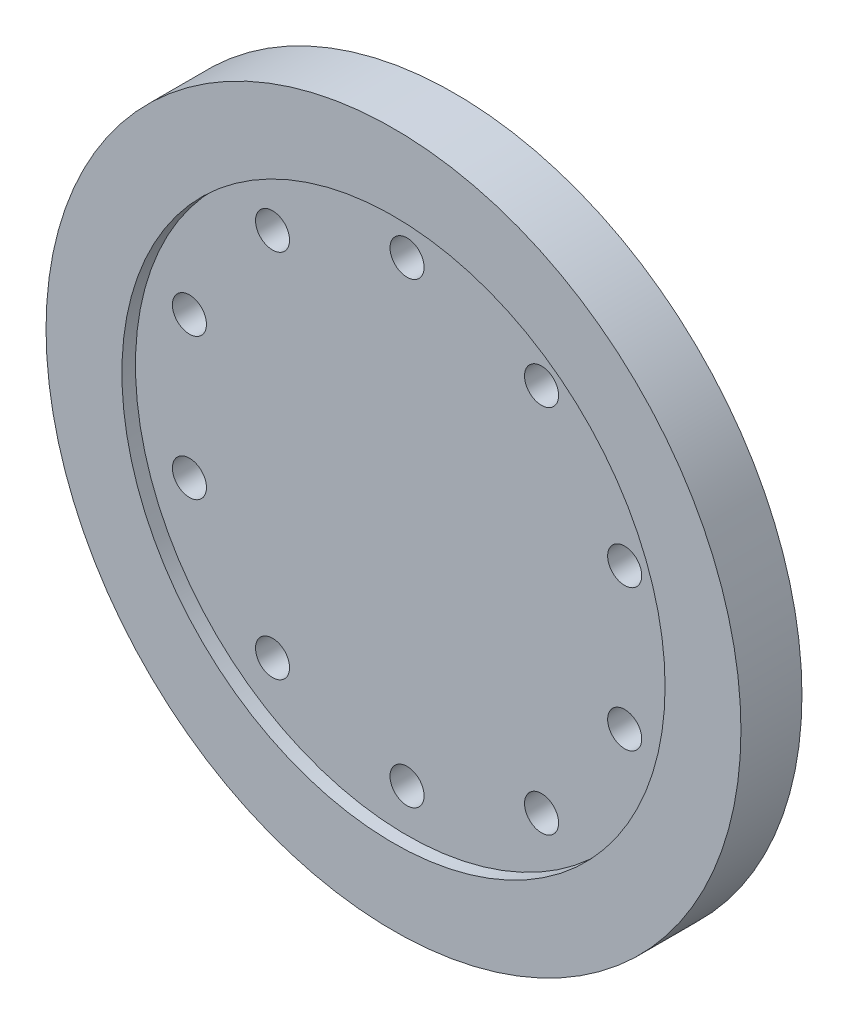
ISO-10303-21;
HEADER;
FILE_DESCRIPTION(('STEP AP214'),'2;1');
FILE_NAME('part.step','',(''),(''),'','','');
FILE_SCHEMA(('AUTOMOTIVE_DESIGN { 1 0 10303 214 1 1 1 1 }'));
ENDSEC;
DATA;
#1=APPLICATION_CONTEXT('core data for automotive mechanical design processes');
#2=APPLICATION_PROTOCOL_DEFINITION('international standard','automotive_design',2000,#1);
#3=PRODUCT_CONTEXT('',#1,'mechanical');
#4=PRODUCT('Part','Part','',(#3));
#5=PRODUCT_RELATED_PRODUCT_CATEGORY('part','',(#4));
#6=PRODUCT_DEFINITION_FORMATION('','',#4);
#7=PRODUCT_DEFINITION_CONTEXT('part definition',#1,'design');
#8=PRODUCT_DEFINITION('design','',#6,#7);
#9=PRODUCT_DEFINITION_SHAPE('','',#8);
#10=(LENGTH_UNIT() NAMED_UNIT(*) SI_UNIT(.MILLI.,.METRE.));
#11=(NAMED_UNIT(*) PLANE_ANGLE_UNIT() SI_UNIT($,.RADIAN.));
#12=(NAMED_UNIT(*) SI_UNIT($,.STERADIAN.) SOLID_ANGLE_UNIT());
#13=UNCERTAINTY_MEASURE_WITH_UNIT(LENGTH_MEASURE(1.E-05),#10,'distance_accuracy_value','');
#14=(GEOMETRIC_REPRESENTATION_CONTEXT(3) GLOBAL_UNCERTAINTY_ASSIGNED_CONTEXT((#13)) GLOBAL_UNIT_ASSIGNED_CONTEXT((#10,
#11,#12)) REPRESENTATION_CONTEXT('',''));
#15=CARTESIAN_POINT('',(0.,0.,0.));
#16=DIRECTION('',(0.,0.,1.));
#17=DIRECTION('',(1.,0.,0.));
#18=AXIS2_PLACEMENT_3D('',#15,#16,#17);
#19=CARTESIAN_POINT('',(-19.837752264871,27.3043235601545,-1.4));
#20=DIRECTION('',(0.,0.,-1.));
#21=DIRECTION('',(-1.,0.,0.));
#22=AXIS2_PLACEMENT_3D('',#19,#20,#21);
#23=CONICAL_SURFACE('',#22,2.5125,0.785398163397448);
#24=CARTESIAN_POINT('',(-19.837752264871,27.3043235601545,-4.5));
#25=DIRECTION('',(0.,0.,1.));
#26=DIRECTION('',(1.,0.,0.));
#27=AXIS2_PLACEMENT_3D('',#24,#25,#26);
#28=CIRCLE('',#27,5.6125);
#29=CARTESIAN_POINT('',(-14.225252264871,27.3043235601545,-4.5));
#30=VERTEX_POINT('',#29);
#31=EDGE_CURVE('E230',#30,#30,#28,.T.);
#32=ORIENTED_EDGE('',*,*,#31,.F.);
#33=EDGE_LOOP('',(#32));
#34=FACE_BOUND('',#33,.T.);
#35=CARTESIAN_POINT('',(-19.837752264871,27.3043235601545,-1.4));
#36=DIRECTION('',(0.,0.,1.));
#37=DIRECTION('',(1.,0.,0.));
#38=AXIS2_PLACEMENT_3D('',#35,#36,#37);
#39=CIRCLE('',#38,2.5125);
#40=CARTESIAN_POINT('',(-17.325252264871,27.3043235601545,-1.4));
#41=VERTEX_POINT('',#40);
#42=EDGE_CURVE('E195',#41,#41,#39,.T.);
#43=ORIENTED_EDGE('',*,*,#42,.T.);
#44=EDGE_LOOP('',(#43));
#45=FACE_BOUND('',#44,.T.);
#46=ADVANCED_FACE('F16',(#34,#45),#23,.F.);
#47=CARTESIAN_POINT('',(0.,33.75,-1.4));
#48=DIRECTION('',(0.,0.,-1.));
#49=DIRECTION('',(-1.,0.,0.));
#50=AXIS2_PLACEMENT_3D('',#47,#48,#49);
#51=CONICAL_SURFACE('',#50,2.5125,0.785398163397448);
#52=CARTESIAN_POINT('',(0.,33.75,-4.5));
#53=DIRECTION('',(0.,0.,1.));
#54=DIRECTION('',(1.,0.,0.));
#55=AXIS2_PLACEMENT_3D('',#52,#53,#54);
#56=CIRCLE('',#55,5.6125);
#57=CARTESIAN_POINT('',(5.6125,33.75,-4.5));
#58=VERTEX_POINT('',#57);
#59=EDGE_CURVE('E227',#58,#58,#56,.T.);
#60=ORIENTED_EDGE('',*,*,#59,.F.);
#61=EDGE_LOOP('',(#60));
#62=FACE_BOUND('',#61,.T.);
#63=CARTESIAN_POINT('',(0.,33.75,-1.4));
#64=DIRECTION('',(0.,0.,1.));
#65=DIRECTION('',(1.,0.,0.));
#66=AXIS2_PLACEMENT_3D('',#63,#64,#65);
#67=CIRCLE('',#66,2.5125);
#68=CARTESIAN_POINT('',(2.5125,33.75,-1.4));
#69=VERTEX_POINT('',#68);
#70=EDGE_CURVE('E196',#69,#69,#67,.T.);
#71=ORIENTED_EDGE('',*,*,#70,.T.);
#72=EDGE_LOOP('',(#71));
#73=FACE_BOUND('',#72,.T.);
#74=ADVANCED_FACE('F273',(#62,#73),#51,.F.);
#75=CARTESIAN_POINT('',(19.837752264871,-27.3043235601545,-1.4));
#76=DIRECTION('',(0.,0.,-1.));
#77=DIRECTION('',(-1.,0.,0.));
#78=AXIS2_PLACEMENT_3D('',#75,#76,#77);
#79=CONICAL_SURFACE('',#78,2.5125,0.785398163397448);
#80=CARTESIAN_POINT('',(19.837752264871,-27.3043235601545,-4.5));
#81=DIRECTION('',(0.,0.,1.));
#82=DIRECTION('',(1.,0.,0.));
#83=AXIS2_PLACEMENT_3D('',#80,#81,#82);
#84=CIRCLE('',#83,5.6125);
#85=CARTESIAN_POINT('',(25.450252264871,-27.3043235601545,-4.5));
#86=VERTEX_POINT('',#85);
#87=EDGE_CURVE('E229',#86,#86,#84,.T.);
#88=ORIENTED_EDGE('',*,*,#87,.F.);
#89=EDGE_LOOP('',(#88));
#90=FACE_BOUND('',#89,.T.);
#91=CARTESIAN_POINT('',(19.837752264871,-27.3043235601545,-1.4));
#92=DIRECTION('',(0.,0.,1.));
#93=DIRECTION('',(1.,0.,0.));
#94=AXIS2_PLACEMENT_3D('',#91,#92,#93);
#95=CIRCLE('',#94,2.5125);
#96=CARTESIAN_POINT('',(22.350252264871,-27.3043235601545,-1.4));
#97=VERTEX_POINT('',#96);
#98=EDGE_CURVE('E167',#97,#97,#95,.T.);
#99=ORIENTED_EDGE('',*,*,#98,.T.);
#100=EDGE_LOOP('',(#99));
#101=FACE_BOUND('',#100,.T.);
#102=ADVANCED_FACE('F168',(#90,#101),#79,.F.);
#103=CARTESIAN_POINT('',(0.,-33.75,-1.4));
#104=DIRECTION('',(0.,0.,-1.));
#105=DIRECTION('',(-1.,0.,0.));
#106=AXIS2_PLACEMENT_3D('',#103,#104,#105);
#107=CONICAL_SURFACE('',#106,2.5125,0.785398163397448);
#108=CARTESIAN_POINT('',(0.,-33.75,-4.5));
#109=DIRECTION('',(0.,0.,1.));
#110=DIRECTION('',(1.,0.,0.));
#111=AXIS2_PLACEMENT_3D('',#108,#109,#110);
#112=CIRCLE('',#111,5.6125);
#113=CARTESIAN_POINT('',(5.6125,-33.75,-4.5));
#114=VERTEX_POINT('',#113);
#115=EDGE_CURVE('E249',#114,#114,#112,.T.);
#116=ORIENTED_EDGE('',*,*,#115,.F.);
#117=EDGE_LOOP('',(#116));
#118=FACE_BOUND('',#117,.T.);
#119=CARTESIAN_POINT('',(0.,-33.75,-1.4));
#120=DIRECTION('',(0.,0.,1.));
#121=DIRECTION('',(1.,0.,0.));
#122=AXIS2_PLACEMENT_3D('',#119,#120,#121);
#123=CIRCLE('',#122,2.5125);
#124=CARTESIAN_POINT('',(2.5125,-33.75,-1.4));
#125=VERTEX_POINT('',#124);
#126=EDGE_CURVE('E182',#125,#125,#123,.T.);
#127=ORIENTED_EDGE('',*,*,#126,.T.);
#128=EDGE_LOOP('',(#127));
#129=FACE_BOUND('',#128,.T.);
#130=ADVANCED_FACE('F328',(#118,#129),#107,.F.);
#131=CARTESIAN_POINT('',(-19.837752264871,-27.3043235601545,-1.4));
#132=DIRECTION('',(0.,0.,-1.));
#133=DIRECTION('',(-1.,0.,0.));
#134=AXIS2_PLACEMENT_3D('',#131,#132,#133);
#135=CONICAL_SURFACE('',#134,2.5125,0.785398163397448);
#136=CARTESIAN_POINT('',(-19.837752264871,-27.3043235601545,-4.5));
#137=DIRECTION('',(0.,0.,1.));
#138=DIRECTION('',(1.,0.,0.));
#139=AXIS2_PLACEMENT_3D('',#136,#137,#138);
#140=CIRCLE('',#139,5.6125);
#141=CARTESIAN_POINT('',(-14.225252264871,-27.3043235601545,-4.5));
#142=VERTEX_POINT('',#141);
#143=EDGE_CURVE('E246',#142,#142,#140,.T.);
#144=ORIENTED_EDGE('',*,*,#143,.F.);
#145=EDGE_LOOP('',(#144));
#146=FACE_BOUND('',#145,.T.);
#147=CARTESIAN_POINT('',(-19.837752264871,-27.3043235601545,-1.4));
#148=DIRECTION('',(0.,0.,1.));
#149=DIRECTION('',(1.,0.,0.));
#150=AXIS2_PLACEMENT_3D('',#147,#148,#149);
#151=CIRCLE('',#150,2.5125);
#152=CARTESIAN_POINT('',(-17.325252264871,-27.3043235601545,-1.4));
#153=VERTEX_POINT('',#152);
#154=EDGE_CURVE('E231',#153,#153,#151,.T.);
#155=ORIENTED_EDGE('',*,*,#154,.T.);
#156=EDGE_LOOP('',(#155));
#157=FACE_BOUND('',#156,.T.);
#158=ADVANCED_FACE('F326',(#146,#157),#135,.F.);
#159=CARTESIAN_POINT('',(-32.0981574249615,10.4293235601545,-1.4));
#160=DIRECTION('',(0.,0.,-1.));
#161=DIRECTION('',(-1.,0.,0.));
#162=AXIS2_PLACEMENT_3D('',#159,#160,#161);
#163=CONICAL_SURFACE('',#162,2.5125,0.785398163397448);
#164=CARTESIAN_POINT('',(-32.0981574249615,10.4293235601545,-4.5));
#165=DIRECTION('',(0.,0.,1.));
#166=DIRECTION('',(1.,0.,0.));
#167=AXIS2_PLACEMENT_3D('',#164,#165,#166);
#168=CIRCLE('',#167,5.6125);
#169=CARTESIAN_POINT('',(-26.4856574249615,10.4293235601545,-4.5));
#170=VERTEX_POINT('',#169);
#171=EDGE_CURVE('E242',#170,#170,#168,.T.);
#172=ORIENTED_EDGE('',*,*,#171,.F.);
#173=EDGE_LOOP('',(#172));
#174=FACE_BOUND('',#173,.T.);
#175=CARTESIAN_POINT('',(-32.0981574249615,10.4293235601545,-1.4));
#176=DIRECTION('',(0.,0.,1.));
#177=DIRECTION('',(1.,0.,0.));
#178=AXIS2_PLACEMENT_3D('',#175,#176,#177);
#179=CIRCLE('',#178,2.5125);
#180=CARTESIAN_POINT('',(-29.5856574249614,10.4293235601545,-1.4));
#181=VERTEX_POINT('',#180);
#182=EDGE_CURVE('E204',#181,#181,#179,.T.);
#183=ORIENTED_EDGE('',*,*,#182,.T.);
#184=EDGE_LOOP('',(#183));
#185=FACE_BOUND('',#184,.T.);
#186=ADVANCED_FACE('F306',(#174,#185),#163,.F.);
#187=CARTESIAN_POINT('',(-32.0981574249615,-10.4293235601545,-1.4));
#188=DIRECTION('',(0.,0.,-1.));
#189=DIRECTION('',(-1.,0.,0.));
#190=AXIS2_PLACEMENT_3D('',#187,#188,#189);
#191=CONICAL_SURFACE('',#190,2.5125,0.785398163397448);
#192=CARTESIAN_POINT('',(-32.0981574249615,-10.4293235601545,-4.5));
#193=DIRECTION('',(0.,0.,1.));
#194=DIRECTION('',(1.,0.,0.));
#195=AXIS2_PLACEMENT_3D('',#192,#193,#194);
#196=CIRCLE('',#195,5.6125);
#197=CARTESIAN_POINT('',(-26.4856574249615,-10.4293235601545,-4.5));
#198=VERTEX_POINT('',#197);
#199=EDGE_CURVE('E239',#198,#198,#196,.T.);
#200=ORIENTED_EDGE('',*,*,#199,.F.);
#201=EDGE_LOOP('',(#200));
#202=FACE_BOUND('',#201,.T.);
#203=CARTESIAN_POINT('',(-32.0981574249615,-10.4293235601545,-1.4));
#204=DIRECTION('',(0.,0.,1.));
#205=DIRECTION('',(1.,0.,0.));
#206=AXIS2_PLACEMENT_3D('',#203,#204,#205);
#207=CIRCLE('',#206,2.5125);
#208=CARTESIAN_POINT('',(-29.5856574249614,-10.4293235601545,-1.4));
#209=VERTEX_POINT('',#208);
#210=EDGE_CURVE('E203',#209,#209,#207,.T.);
#211=ORIENTED_EDGE('',*,*,#210,.T.);
#212=EDGE_LOOP('',(#211));
#213=FACE_BOUND('',#212,.T.);
#214=ADVANCED_FACE('F302',(#202,#213),#191,.F.);
#215=CARTESIAN_POINT('',(32.0981574249615,-10.4293235601545,-1.4));
#216=DIRECTION('',(0.,0.,-1.));
#217=DIRECTION('',(-1.,0.,0.));
#218=AXIS2_PLACEMENT_3D('',#215,#216,#217);
#219=CONICAL_SURFACE('',#218,2.5125,0.785398163397448);
#220=CARTESIAN_POINT('',(32.0981574249615,-10.4293235601545,-4.5));
#221=DIRECTION('',(0.,0.,1.));
#222=DIRECTION('',(1.,0.,0.));
#223=AXIS2_PLACEMENT_3D('',#220,#221,#222);
#224=CIRCLE('',#223,5.6125);
#225=CARTESIAN_POINT('',(37.7106574249614,-10.4293235601545,-4.5));
#226=VERTEX_POINT('',#225);
#227=EDGE_CURVE('E20',#226,#226,#224,.T.);
#228=ORIENTED_EDGE('',*,*,#227,.F.);
#229=EDGE_LOOP('',(#228));
#230=FACE_BOUND('',#229,.T.);
#231=CARTESIAN_POINT('',(32.0981574249615,-10.4293235601545,-1.4));
#232=DIRECTION('',(0.,0.,1.));
#233=DIRECTION('',(1.,0.,0.));
#234=AXIS2_PLACEMENT_3D('',#231,#232,#233);
#235=CIRCLE('',#234,2.5125);
#236=CARTESIAN_POINT('',(34.6106574249615,-10.4293235601545,-1.4));
#237=VERTEX_POINT('',#236);
#238=EDGE_CURVE('E179',#237,#237,#235,.T.);
#239=ORIENTED_EDGE('',*,*,#238,.T.);
#240=EDGE_LOOP('',(#239));
#241=FACE_BOUND('',#240,.T.);
#242=ADVANCED_FACE('F305',(#230,#241),#219,.F.);
#243=CARTESIAN_POINT('',(32.0981574249615,10.4293235601545,-1.4));
#244=DIRECTION('',(0.,0.,-1.));
#245=DIRECTION('',(-1.,0.,0.));
#246=AXIS2_PLACEMENT_3D('',#243,#244,#245);
#247=CONICAL_SURFACE('',#246,2.5125,0.785398163397448);
#248=CARTESIAN_POINT('',(32.0981574249615,10.4293235601545,-4.5));
#249=DIRECTION('',(0.,0.,1.));
#250=DIRECTION('',(1.,0.,0.));
#251=AXIS2_PLACEMENT_3D('',#248,#249,#250);
#252=CIRCLE('',#251,5.6125);
#253=CARTESIAN_POINT('',(37.7106574249614,10.4293235601545,-4.5));
#254=VERTEX_POINT('',#253);
#255=EDGE_CURVE('E362',#254,#254,#252,.T.);
#256=ORIENTED_EDGE('',*,*,#255,.F.);
#257=EDGE_LOOP('',(#256));
#258=FACE_BOUND('',#257,.T.);
#259=CARTESIAN_POINT('',(32.0981574249615,10.4293235601545,-1.4));
#260=DIRECTION('',(0.,0.,1.));
#261=DIRECTION('',(1.,0.,0.));
#262=AXIS2_PLACEMENT_3D('',#259,#260,#261);
#263=CIRCLE('',#262,2.5125);
#264=CARTESIAN_POINT('',(34.6106574249615,10.4293235601545,-1.4));
#265=VERTEX_POINT('',#264);
#266=EDGE_CURVE('E226',#265,#265,#263,.T.);
#267=ORIENTED_EDGE('',*,*,#266,.T.);
#268=EDGE_LOOP('',(#267));
#269=FACE_BOUND('',#268,.T.);
#270=ADVANCED_FACE('F300',(#258,#269),#247,.F.);
#271=CARTESIAN_POINT('',(19.837752264871,27.3043235601545,-1.4));
#272=DIRECTION('',(0.,0.,-1.));
#273=DIRECTION('',(-1.,0.,0.));
#274=AXIS2_PLACEMENT_3D('',#271,#272,#273);
#275=CONICAL_SURFACE('',#274,2.5125,0.785398163397448);
#276=CARTESIAN_POINT('',(19.837752264871,27.3043235601545,-4.5));
#277=DIRECTION('',(0.,0.,1.));
#278=DIRECTION('',(1.,0.,0.));
#279=AXIS2_PLACEMENT_3D('',#276,#277,#278);
#280=CIRCLE('',#279,5.6125);
#281=CARTESIAN_POINT('',(25.450252264871,27.3043235601545,-4.5));
#282=VERTEX_POINT('',#281);
#283=EDGE_CURVE('E27',#282,#282,#280,.T.);
#284=ORIENTED_EDGE('',*,*,#283,.F.);
#285=EDGE_LOOP('',(#284));
#286=FACE_BOUND('',#285,.T.);
#287=CARTESIAN_POINT('',(19.837752264871,27.3043235601545,-1.4));
#288=DIRECTION('',(0.,0.,1.));
#289=DIRECTION('',(1.,0.,0.));
#290=AXIS2_PLACEMENT_3D('',#287,#288,#289);
#291=CIRCLE('',#290,2.5125);
#292=CARTESIAN_POINT('',(22.350252264871,27.3043235601545,-1.4));
#293=VERTEX_POINT('',#292);
#294=EDGE_CURVE('E207',#293,#293,#291,.T.);
#295=ORIENTED_EDGE('',*,*,#294,.T.);
#296=EDGE_LOOP('',(#295));
#297=FACE_BOUND('',#296,.T.);
#298=ADVANCED_FACE('F296',(#286,#297),#275,.F.);
#299=CARTESIAN_POINT('',(0.,0.,2.5));
#300=DIRECTION('',(0.,0.,1.));
#301=DIRECTION('',(1.,0.,0.));
#302=AXIS2_PLACEMENT_3D('',#299,#300,#301);
#303=PLANE('',#302);
#304=CARTESIAN_POINT('',(0.,0.,2.5));
#305=DIRECTION('',(0.,0.,1.));
#306=DIRECTION('',(1.,0.,0.));
#307=AXIS2_PLACEMENT_3D('',#304,#305,#306);
#308=CIRCLE('',#307,40.06);
#309=CARTESIAN_POINT('',(40.06,0.,2.5));
#310=VERTEX_POINT('',#309);
#311=EDGE_CURVE('E11',#310,#310,#308,.T.);
#312=ORIENTED_EDGE('',*,*,#311,.T.);
#313=EDGE_LOOP('',(#312));
#314=FACE_BOUND('',#313,.T.);
#315=CARTESIAN_POINT('',(-19.837752264871,27.3043235601545,2.5));
#316=DIRECTION('',(0.,0.,1.));
#317=DIRECTION('',(1.,0.,0.));
#318=AXIS2_PLACEMENT_3D('',#315,#316,#317);
#319=CIRCLE('',#318,2.5125);
#320=CARTESIAN_POINT('',(-17.325252264871,27.3043235601545,2.5));
#321=VERTEX_POINT('',#320);
#322=EDGE_CURVE('E208',#321,#321,#319,.T.);
#323=ORIENTED_EDGE('',*,*,#322,.F.);
#324=EDGE_LOOP('',(#323));
#325=FACE_BOUND('',#324,.T.);
#326=CARTESIAN_POINT('',(-32.0981574249615,10.4293235601545,2.5));
#327=DIRECTION('',(0.,0.,1.));
#328=DIRECTION('',(1.,0.,0.));
#329=AXIS2_PLACEMENT_3D('',#326,#327,#328);
#330=CIRCLE('',#329,2.5125);
#331=CARTESIAN_POINT('',(-29.5856574249614,10.4293235601545,2.5));
#332=VERTEX_POINT('',#331);
#333=EDGE_CURVE('E200',#332,#332,#330,.T.);
#334=ORIENTED_EDGE('',*,*,#333,.F.);
#335=EDGE_LOOP('',(#334));
#336=FACE_BOUND('',#335,.T.);
#337=CARTESIAN_POINT('',(-32.0981574249615,-10.4293235601545,2.5));
#338=DIRECTION('',(0.,0.,1.));
#339=DIRECTION('',(1.,0.,0.));
#340=AXIS2_PLACEMENT_3D('',#337,#338,#339);
#341=CIRCLE('',#340,2.5125);
#342=CARTESIAN_POINT('',(-29.5856574249614,-10.4293235601545,2.5));
#343=VERTEX_POINT('',#342);
#344=EDGE_CURVE('E235',#343,#343,#341,.T.);
#345=ORIENTED_EDGE('',*,*,#344,.F.);
#346=EDGE_LOOP('',(#345));
#347=FACE_BOUND('',#346,.T.);
#348=CARTESIAN_POINT('',(-19.837752264871,-27.3043235601545,2.5));
#349=DIRECTION('',(0.,0.,1.));
#350=DIRECTION('',(1.,0.,0.));
#351=AXIS2_PLACEMENT_3D('',#348,#349,#350);
#352=CIRCLE('',#351,2.5125);
#353=CARTESIAN_POINT('',(-17.325252264871,-27.3043235601545,2.5));
#354=VERTEX_POINT('',#353);
#355=EDGE_CURVE('E234',#354,#354,#352,.T.);
#356=ORIENTED_EDGE('',*,*,#355,.F.);
#357=EDGE_LOOP('',(#356));
#358=FACE_BOUND('',#357,.T.);
#359=CARTESIAN_POINT('',(0.,-33.75,2.5));
#360=DIRECTION('',(0.,0.,1.));
#361=DIRECTION('',(1.,0.,0.));
#362=AXIS2_PLACEMENT_3D('',#359,#360,#361);
#363=CIRCLE('',#362,2.5125);
#364=CARTESIAN_POINT('',(2.5125,-33.75,2.5));
#365=VERTEX_POINT('',#364);
#366=EDGE_CURVE('E172',#365,#365,#363,.T.);
#367=ORIENTED_EDGE('',*,*,#366,.F.);
#368=EDGE_LOOP('',(#367));
#369=FACE_BOUND('',#368,.T.);
#370=CARTESIAN_POINT('',(19.837752264871,-27.3043235601545,2.5));
#371=DIRECTION('',(0.,0.,1.));
#372=DIRECTION('',(1.,0.,0.));
#373=AXIS2_PLACEMENT_3D('',#370,#371,#372);
#374=CIRCLE('',#373,2.5125);
#375=CARTESIAN_POINT('',(22.350252264871,-27.3043235601545,2.5));
#376=VERTEX_POINT('',#375);
#377=EDGE_CURVE('E171',#376,#376,#374,.T.);
#378=ORIENTED_EDGE('',*,*,#377,.F.);
#379=EDGE_LOOP('',(#378));
#380=FACE_BOUND('',#379,.T.);
#381=CARTESIAN_POINT('',(32.0981574249615,-10.4293235601545,2.5));
#382=DIRECTION('',(0.,0.,1.));
#383=DIRECTION('',(1.,0.,0.));
#384=AXIS2_PLACEMENT_3D('',#381,#382,#383);
#385=CIRCLE('',#384,2.5125);
#386=CARTESIAN_POINT('',(34.6106574249615,-10.4293235601545,2.5));
#387=VERTEX_POINT('',#386);
#388=EDGE_CURVE('E238',#387,#387,#385,.T.);
#389=ORIENTED_EDGE('',*,*,#388,.F.);
#390=EDGE_LOOP('',(#389));
#391=FACE_BOUND('',#390,.T.);
#392=CARTESIAN_POINT('',(32.0981574249615,10.4293235601545,2.5));
#393=DIRECTION('',(0.,0.,1.));
#394=DIRECTION('',(1.,0.,0.));
#395=AXIS2_PLACEMENT_3D('',#392,#393,#394);
#396=CIRCLE('',#395,2.5125);
#397=CARTESIAN_POINT('',(34.6106574249615,10.4293235601545,2.5));
#398=VERTEX_POINT('',#397);
#399=EDGE_CURVE('E224',#398,#398,#396,.T.);
#400=ORIENTED_EDGE('',*,*,#399,.F.);
#401=EDGE_LOOP('',(#400));
#402=FACE_BOUND('',#401,.T.);
#403=CARTESIAN_POINT('',(19.837752264871,27.3043235601545,2.5));
#404=DIRECTION('',(0.,0.,1.));
#405=DIRECTION('',(1.,0.,0.));
#406=AXIS2_PLACEMENT_3D('',#403,#404,#405);
#407=CIRCLE('',#406,2.5125);
#408=CARTESIAN_POINT('',(22.350252264871,27.3043235601545,2.5));
#409=VERTEX_POINT('',#408);
#410=EDGE_CURVE('E199',#409,#409,#407,.T.);
#411=ORIENTED_EDGE('',*,*,#410,.F.);
#412=EDGE_LOOP('',(#411));
#413=FACE_BOUND('',#412,.T.);
#414=CARTESIAN_POINT('',(0.,33.75,2.5));
#415=DIRECTION('',(0.,0.,1.));
#416=DIRECTION('',(1.,0.,0.));
#417=AXIS2_PLACEMENT_3D('',#414,#415,#416);
#418=CIRCLE('',#417,2.5125);
#419=CARTESIAN_POINT('',(2.5125,33.75,2.5));
#420=VERTEX_POINT('',#419);
#421=EDGE_CURVE('E192',#420,#420,#418,.T.);
#422=ORIENTED_EDGE('',*,*,#421,.F.);
#423=EDGE_LOOP('',(#422));
#424=FACE_BOUND('',#423,.T.);
#425=ADVANCED_FACE('F299',(#314,#325,#336,#347,#358,#369,#380,#391,#402,#413,#424),#303,.T.);
#426=CARTESIAN_POINT('',(0.,0.,2.5));
#427=DIRECTION('',(0.,0.,1.));
#428=DIRECTION('',(1.,0.,0.));
#429=AXIS2_PLACEMENT_3D('',#426,#427,#428);
#430=CYLINDRICAL_SURFACE('',#429,40.06);
#431=CARTESIAN_POINT('',(0.,0.,4.5));
#432=DIRECTION('',(0.,0.,1.));
#433=DIRECTION('',(1.,0.,0.));
#434=AXIS2_PLACEMENT_3D('',#431,#432,#433);
#435=CIRCLE('',#434,40.06);
#436=CARTESIAN_POINT('',(40.06,0.,4.5));
#437=VERTEX_POINT('',#436);
#438=EDGE_CURVE('E190',#437,#437,#435,.T.);
#439=ORIENTED_EDGE('',*,*,#438,.T.);
#440=EDGE_LOOP('',(#439));
#441=FACE_BOUND('',#440,.T.);
#442=ORIENTED_EDGE('',*,*,#311,.F.);
#443=EDGE_LOOP('',(#442));
#444=FACE_BOUND('',#443,.T.);
#445=ADVANCED_FACE('F350',(#441,#444),#430,.F.);
#446=CARTESIAN_POINT('',(0.,0.,-4.5));
#447=DIRECTION('',(0.,0.,1.));
#448=DIRECTION('',(1.,0.,0.));
#449=AXIS2_PLACEMENT_3D('',#446,#447,#448);
#450=PLANE('',#449);
#451=CARTESIAN_POINT('',(0.,0.,-4.5));
#452=DIRECTION('',(0.,0.,1.));
#453=DIRECTION('',(1.,0.,0.));
#454=AXIS2_PLACEMENT_3D('',#451,#452,#453);
#455=CIRCLE('',#454,51.25);
#456=CARTESIAN_POINT('',(51.25,0.,-4.5));
#457=VERTEX_POINT('',#456);
#458=EDGE_CURVE('E187',#457,#457,#455,.T.);
#459=ORIENTED_EDGE('',*,*,#458,.F.);
#460=EDGE_LOOP('',(#459));
#461=FACE_BOUND('',#460,.T.);
#462=ORIENTED_EDGE('',*,*,#283,.T.);
#463=EDGE_LOOP('',(#462));
#464=FACE_BOUND('',#463,.T.);
#465=ORIENTED_EDGE('',*,*,#255,.T.);
#466=EDGE_LOOP('',(#465));
#467=FACE_BOUND('',#466,.T.);
#468=ORIENTED_EDGE('',*,*,#227,.T.);
#469=EDGE_LOOP('',(#468));
#470=FACE_BOUND('',#469,.T.);
#471=ORIENTED_EDGE('',*,*,#199,.T.);
#472=EDGE_LOOP('',(#471));
#473=FACE_BOUND('',#472,.T.);
#474=ORIENTED_EDGE('',*,*,#171,.T.);
#475=EDGE_LOOP('',(#474));
#476=FACE_BOUND('',#475,.T.);
#477=ORIENTED_EDGE('',*,*,#143,.T.);
#478=EDGE_LOOP('',(#477));
#479=FACE_BOUND('',#478,.T.);
#480=ORIENTED_EDGE('',*,*,#115,.T.);
#481=EDGE_LOOP('',(#480));
#482=FACE_BOUND('',#481,.T.);
#483=ORIENTED_EDGE('',*,*,#87,.T.);
#484=EDGE_LOOP('',(#483));
#485=FACE_BOUND('',#484,.T.);
#486=ORIENTED_EDGE('',*,*,#59,.T.);
#487=EDGE_LOOP('',(#486));
#488=FACE_BOUND('',#487,.T.);
#489=ORIENTED_EDGE('',*,*,#31,.T.);
#490=EDGE_LOOP('',(#489));
#491=FACE_BOUND('',#490,.T.);
#492=ADVANCED_FACE('F270',(#461,#464,#467,#470,#473,#476,#479,#482,#485,#488,#491),#450,.F.);
#493=CARTESIAN_POINT('',(0.,0.,4.5));
#494=DIRECTION('',(0.,0.,1.));
#495=DIRECTION('',(1.,0.,0.));
#496=AXIS2_PLACEMENT_3D('',#493,#494,#495);
#497=PLANE('',#496);
#498=CARTESIAN_POINT('',(0.,0.,4.5));
#499=DIRECTION('',(0.,0.,1.));
#500=DIRECTION('',(1.,0.,0.));
#501=AXIS2_PLACEMENT_3D('',#498,#499,#500);
#502=CIRCLE('',#501,51.25);
#503=CARTESIAN_POINT('',(51.25,0.,4.5));
#504=VERTEX_POINT('',#503);
#505=EDGE_CURVE('E191',#504,#504,#502,.T.);
#506=ORIENTED_EDGE('',*,*,#505,.T.);
#507=EDGE_LOOP('',(#506));
#508=FACE_BOUND('',#507,.T.);
#509=ORIENTED_EDGE('',*,*,#438,.F.);
#510=EDGE_LOOP('',(#509));
#511=FACE_BOUND('',#510,.T.);
#512=ADVANCED_FACE('F292',(#508,#511),#497,.T.);
#513=CARTESIAN_POINT('',(0.,0.,4.5));
#514=DIRECTION('',(0.,0.,-1.));
#515=DIRECTION('',(-1.,0.,0.));
#516=AXIS2_PLACEMENT_3D('',#513,#514,#515);
#517=CYLINDRICAL_SURFACE('',#516,51.25);
#518=ORIENTED_EDGE('',*,*,#458,.T.);
#519=EDGE_LOOP('',(#518));
#520=FACE_BOUND('',#519,.T.);
#521=ORIENTED_EDGE('',*,*,#505,.F.);
#522=EDGE_LOOP('',(#521));
#523=FACE_BOUND('',#522,.T.);
#524=ADVANCED_FACE('F291',(#520,#523),#517,.T.);
#525=CARTESIAN_POINT('',(-19.837752264871,27.3043235601545,4.5));
#526=DIRECTION('',(0.,0.,-1.));
#527=DIRECTION('',(-1.,0.,0.));
#528=AXIS2_PLACEMENT_3D('',#525,#526,#527);
#529=CYLINDRICAL_SURFACE('',#528,2.5125);
#530=ORIENTED_EDGE('',*,*,#322,.T.);
#531=EDGE_LOOP('',(#530));
#532=FACE_BOUND('',#531,.T.);
#533=ORIENTED_EDGE('',*,*,#42,.F.);
#534=EDGE_LOOP('',(#533));
#535=FACE_BOUND('',#534,.T.);
#536=ADVANCED_FACE('F287',(#532,#535),#529,.F.);
#537=CARTESIAN_POINT('',(0.,33.75,4.5));
#538=DIRECTION('',(0.,0.,-1.));
#539=DIRECTION('',(-1.,0.,0.));
#540=AXIS2_PLACEMENT_3D('',#537,#538,#539);
#541=CYLINDRICAL_SURFACE('',#540,2.5125);
#542=ORIENTED_EDGE('',*,*,#421,.T.);
#543=EDGE_LOOP('',(#542));
#544=FACE_BOUND('',#543,.T.);
#545=ORIENTED_EDGE('',*,*,#70,.F.);
#546=EDGE_LOOP('',(#545));
#547=FACE_BOUND('',#546,.T.);
#548=ADVANCED_FACE('F290',(#544,#547),#541,.F.);
#549=CARTESIAN_POINT('',(19.837752264871,27.3043235601545,4.5));
#550=DIRECTION('',(0.,0.,-1.));
#551=DIRECTION('',(-1.,0.,0.));
#552=AXIS2_PLACEMENT_3D('',#549,#550,#551);
#553=CYLINDRICAL_SURFACE('',#552,2.5125);
#554=ORIENTED_EDGE('',*,*,#410,.T.);
#555=EDGE_LOOP('',(#554));
#556=FACE_BOUND('',#555,.T.);
#557=ORIENTED_EDGE('',*,*,#294,.F.);
#558=EDGE_LOOP('',(#557));
#559=FACE_BOUND('',#558,.T.);
#560=ADVANCED_FACE('F18',(#556,#559),#553,.F.);
#561=CARTESIAN_POINT('',(32.0981574249615,10.4293235601545,4.5));
#562=DIRECTION('',(0.,0.,-1.));
#563=DIRECTION('',(-1.,0.,0.));
#564=AXIS2_PLACEMENT_3D('',#561,#562,#563);
#565=CYLINDRICAL_SURFACE('',#564,2.5125);
#566=ORIENTED_EDGE('',*,*,#399,.T.);
#567=EDGE_LOOP('',(#566));
#568=FACE_BOUND('',#567,.T.);
#569=ORIENTED_EDGE('',*,*,#266,.F.);
#570=EDGE_LOOP('',(#569));
#571=FACE_BOUND('',#570,.T.);
#572=ADVANCED_FACE('F347',(#568,#571),#565,.F.);
#573=CARTESIAN_POINT('',(32.0981574249615,-10.4293235601545,4.5));
#574=DIRECTION('',(0.,0.,-1.));
#575=DIRECTION('',(-1.,0.,0.));
#576=AXIS2_PLACEMENT_3D('',#573,#574,#575);
#577=CYLINDRICAL_SURFACE('',#576,2.5125);
#578=ORIENTED_EDGE('',*,*,#388,.T.);
#579=EDGE_LOOP('',(#578));
#580=FACE_BOUND('',#579,.T.);
#581=ORIENTED_EDGE('',*,*,#238,.F.);
#582=EDGE_LOOP('',(#581));
#583=FACE_BOUND('',#582,.T.);
#584=ADVANCED_FACE('F311',(#580,#583),#577,.F.);
#585=CARTESIAN_POINT('',(19.837752264871,-27.3043235601545,4.5));
#586=DIRECTION('',(0.,0.,-1.));
#587=DIRECTION('',(-1.,0.,0.));
#588=AXIS2_PLACEMENT_3D('',#585,#586,#587);
#589=CYLINDRICAL_SURFACE('',#588,2.5125);
#590=ORIENTED_EDGE('',*,*,#377,.T.);
#591=EDGE_LOOP('',(#590));
#592=FACE_BOUND('',#591,.T.);
#593=ORIENTED_EDGE('',*,*,#98,.F.);
#594=EDGE_LOOP('',(#593));
#595=FACE_BOUND('',#594,.T.);
#596=ADVANCED_FACE('F308',(#592,#595),#589,.F.);
#597=CARTESIAN_POINT('',(0.,-33.75,4.5));
#598=DIRECTION('',(0.,0.,-1.));
#599=DIRECTION('',(-1.,0.,0.));
#600=AXIS2_PLACEMENT_3D('',#597,#598,#599);
#601=CYLINDRICAL_SURFACE('',#600,2.5125);
#602=ORIENTED_EDGE('',*,*,#366,.T.);
#603=EDGE_LOOP('',(#602));
#604=FACE_BOUND('',#603,.T.);
#605=ORIENTED_EDGE('',*,*,#126,.F.);
#606=EDGE_LOOP('',(#605));
#607=FACE_BOUND('',#606,.T.);
#608=ADVANCED_FACE('F310',(#604,#607),#601,.F.);
#609=CARTESIAN_POINT('',(-19.837752264871,-27.3043235601545,4.5));
#610=DIRECTION('',(0.,0.,-1.));
#611=DIRECTION('',(-1.,0.,0.));
#612=AXIS2_PLACEMENT_3D('',#609,#610,#611);
#613=CYLINDRICAL_SURFACE('',#612,2.5125);
#614=ORIENTED_EDGE('',*,*,#355,.T.);
#615=EDGE_LOOP('',(#614));
#616=FACE_BOUND('',#615,.T.);
#617=ORIENTED_EDGE('',*,*,#154,.F.);
#618=EDGE_LOOP('',(#617));
#619=FACE_BOUND('',#618,.T.);
#620=ADVANCED_FACE('F313',(#616,#619),#613,.F.);
#621=CARTESIAN_POINT('',(-32.0981574249615,-10.4293235601545,4.5));
#622=DIRECTION('',(0.,0.,-1.));
#623=DIRECTION('',(-1.,0.,0.));
#624=AXIS2_PLACEMENT_3D('',#621,#622,#623);
#625=CYLINDRICAL_SURFACE('',#624,2.5125);
#626=ORIENTED_EDGE('',*,*,#344,.T.);
#627=EDGE_LOOP('',(#626));
#628=FACE_BOUND('',#627,.T.);
#629=ORIENTED_EDGE('',*,*,#210,.F.);
#630=EDGE_LOOP('',(#629));
#631=FACE_BOUND('',#630,.T.);
#632=ADVANCED_FACE('F282',(#628,#631),#625,.F.);
#633=CARTESIAN_POINT('',(-32.0981574249615,10.4293235601545,4.5));
#634=DIRECTION('',(0.,0.,-1.));
#635=DIRECTION('',(-1.,0.,0.));
#636=AXIS2_PLACEMENT_3D('',#633,#634,#635);
#637=CYLINDRICAL_SURFACE('',#636,2.5125);
#638=ORIENTED_EDGE('',*,*,#333,.T.);
#639=EDGE_LOOP('',(#638));
#640=FACE_BOUND('',#639,.T.);
#641=ORIENTED_EDGE('',*,*,#182,.F.);
#642=EDGE_LOOP('',(#641));
#643=FACE_BOUND('',#642,.T.);
#644=ADVANCED_FACE('F283',(#640,#643),#637,.F.);
#645=CLOSED_SHELL('',(#46,#74,#102,#130,#158,#186,#214,#242,#270,#298,#425,#445,#492,#512,#524,
#536,#548,#560,#572,#584,#596,#608,#620,#632,#644));
#646=MANIFOLD_SOLID_BREP('B1',#645);
#647=ADVANCED_BREP_SHAPE_REPRESENTATION('',(#18,#646),#14);
#648=SHAPE_DEFINITION_REPRESENTATION(#9,#647);
ENDSEC;
END-ISO-10303-21;
